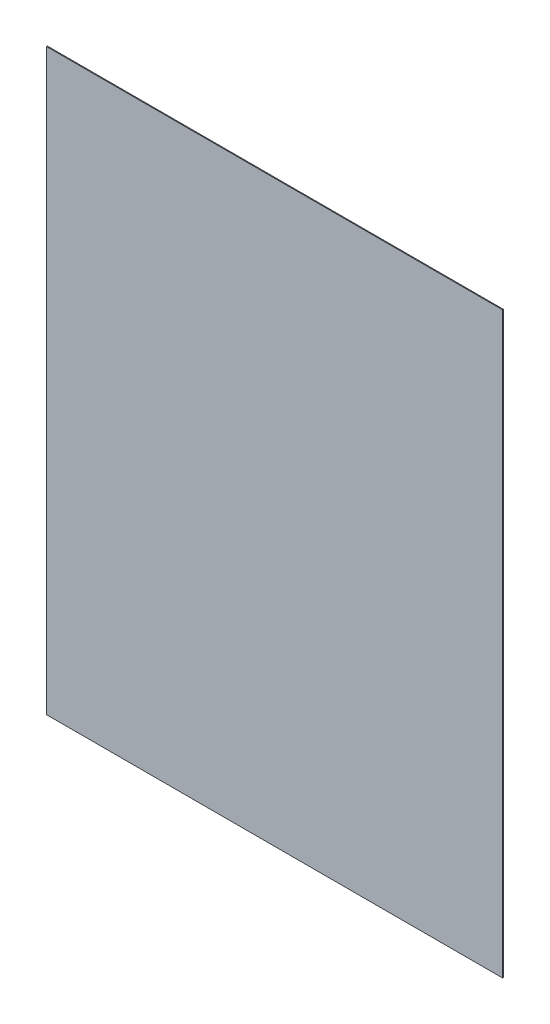
ISO-10303-21;
HEADER;
FILE_DESCRIPTION(('STEP AP214'),'2;1');
FILE_NAME('part.step','',(''),(''),'','','');
FILE_SCHEMA(('AUTOMOTIVE_DESIGN { 1 0 10303 214 1 1 1 1 }'));
ENDSEC;
DATA;
#1=APPLICATION_CONTEXT('core data for automotive mechanical design processes');
#2=APPLICATION_PROTOCOL_DEFINITION('international standard','automotive_design',2000,#1);
#3=PRODUCT_CONTEXT('',#1,'mechanical');
#4=PRODUCT('Part','Part','',(#3));
#5=PRODUCT_RELATED_PRODUCT_CATEGORY('part','',(#4));
#6=PRODUCT_DEFINITION_FORMATION('','',#4);
#7=PRODUCT_DEFINITION_CONTEXT('part definition',#1,'design');
#8=PRODUCT_DEFINITION('design','',#6,#7);
#9=PRODUCT_DEFINITION_SHAPE('','',#8);
#10=(LENGTH_UNIT() NAMED_UNIT(*) SI_UNIT(.MILLI.,.METRE.));
#11=(NAMED_UNIT(*) PLANE_ANGLE_UNIT() SI_UNIT($,.RADIAN.));
#12=(NAMED_UNIT(*) SI_UNIT($,.STERADIAN.) SOLID_ANGLE_UNIT());
#13=UNCERTAINTY_MEASURE_WITH_UNIT(LENGTH_MEASURE(1.E-05),#10,'distance_accuracy_value','');
#14=(GEOMETRIC_REPRESENTATION_CONTEXT(3) GLOBAL_UNCERTAINTY_ASSIGNED_CONTEXT((#13)) GLOBAL_UNIT_ASSIGNED_CONTEXT((#10,
#11,#12)) REPRESENTATION_CONTEXT('',''));
#15=CARTESIAN_POINT('',(0.,0.,0.));
#16=DIRECTION('',(0.,0.,1.));
#17=DIRECTION('',(1.,0.,0.));
#18=AXIS2_PLACEMENT_3D('',#15,#16,#17);
#19=CARTESIAN_POINT('',(260.5,-330.5,1.));
#20=DIRECTION('',(-1.,0.,0.));
#21=DIRECTION('',(0.,0.,1.));
#22=AXIS2_PLACEMENT_3D('',#19,#20,#21);
#23=PLANE('',#22);
#24=DIRECTION('',(0.,1.,0.));
#25=VECTOR('',#24,1.);
#26=CARTESIAN_POINT('',(260.5,-330.5,0.));
#27=LINE('',#26,#25);
#28=CARTESIAN_POINT('',(260.5,-330.5,0.));
#29=VERTEX_POINT('',#28);
#30=CARTESIAN_POINT('',(260.5,330.5,0.));
#31=VERTEX_POINT('',#30);
#32=EDGE_CURVE('E107',#29,#31,#27,.T.);
#33=ORIENTED_EDGE('',*,*,#32,.T.);
#34=DIRECTION('',(0.,0.,-1.));
#35=VECTOR('',#34,1.);
#36=CARTESIAN_POINT('',(260.5,330.5,1.));
#37=LINE('',#36,#35);
#38=CARTESIAN_POINT('',(260.5,330.5,1.));
#39=VERTEX_POINT('',#38);
#40=EDGE_CURVE('E11',#39,#31,#37,.T.);
#41=ORIENTED_EDGE('',*,*,#40,.F.);
#42=DIRECTION('',(0.,1.,0.));
#43=VECTOR('',#42,1.);
#44=CARTESIAN_POINT('',(260.5,-330.5,1.));
#45=LINE('',#44,#43);
#46=CARTESIAN_POINT('',(260.5,-330.5,1.));
#47=VERTEX_POINT('',#46);
#48=EDGE_CURVE('E91',#47,#39,#45,.T.);
#49=ORIENTED_EDGE('',*,*,#48,.F.);
#50=DIRECTION('',(0.,0.,-1.));
#51=VECTOR('',#50,1.);
#52=CARTESIAN_POINT('',(260.5,-330.5,1.));
#53=LINE('',#52,#51);
#54=EDGE_CURVE('E103',#47,#29,#53,.T.);
#55=ORIENTED_EDGE('',*,*,#54,.T.);
#56=EDGE_LOOP('',(#33,#41,#49,#55));
#57=FACE_BOUND('',#56,.T.);
#58=ADVANCED_FACE('F39',(#57),#23,.F.);
#59=CARTESIAN_POINT('',(-260.5,330.5,1.));
#60=DIRECTION('',(0.,-1.,0.));
#61=DIRECTION('',(0.,0.,-1.));
#62=AXIS2_PLACEMENT_3D('',#59,#60,#61);
#63=PLANE('',#62);
#64=DIRECTION('',(-1.,0.,0.));
#65=VECTOR('',#64,1.);
#66=CARTESIAN_POINT('',(-260.5,330.5,0.));
#67=LINE('',#66,#65);
#68=CARTESIAN_POINT('',(-260.5,330.5,0.));
#69=VERTEX_POINT('',#68);
#70=EDGE_CURVE('E96',#31,#69,#67,.T.);
#71=ORIENTED_EDGE('',*,*,#70,.T.);
#72=DIRECTION('',(0.,0.,-1.));
#73=VECTOR('',#72,1.);
#74=CARTESIAN_POINT('',(-260.5,330.5,1.));
#75=LINE('',#74,#73);
#76=CARTESIAN_POINT('',(-260.5,330.5,1.));
#77=VERTEX_POINT('',#76);
#78=EDGE_CURVE('E48',#77,#69,#75,.T.);
#79=ORIENTED_EDGE('',*,*,#78,.F.);
#80=DIRECTION('',(-1.,0.,0.));
#81=VECTOR('',#80,1.);
#82=CARTESIAN_POINT('',(-260.5,330.5,1.));
#83=LINE('',#82,#81);
#84=EDGE_CURVE('E86',#39,#77,#83,.T.);
#85=ORIENTED_EDGE('',*,*,#84,.F.);
#86=ORIENTED_EDGE('',*,*,#40,.T.);
#87=EDGE_LOOP('',(#71,#79,#85,#86));
#88=FACE_BOUND('',#87,.T.);
#89=ADVANCED_FACE('F95',(#88),#63,.F.);
#90=CARTESIAN_POINT('',(-260.5,-330.5,1.));
#91=DIRECTION('',(1.,0.,0.));
#92=DIRECTION('',(0.,0.,-1.));
#93=AXIS2_PLACEMENT_3D('',#90,#91,#92);
#94=PLANE('',#93);
#95=DIRECTION('',(0.,-1.,0.));
#96=VECTOR('',#95,1.);
#97=CARTESIAN_POINT('',(-260.5,-330.5,0.));
#98=LINE('',#97,#96);
#99=CARTESIAN_POINT('',(-260.5,-330.5,0.));
#100=VERTEX_POINT('',#99);
#101=EDGE_CURVE('E73',#69,#100,#98,.T.);
#102=ORIENTED_EDGE('',*,*,#101,.T.);
#103=DIRECTION('',(0.,0.,-1.));
#104=VECTOR('',#103,1.);
#105=CARTESIAN_POINT('',(-260.5,-330.5,1.));
#106=LINE('',#105,#104);
#107=CARTESIAN_POINT('',(-260.5,-330.5,1.));
#108=VERTEX_POINT('',#107);
#109=EDGE_CURVE('E98',#108,#100,#106,.T.);
#110=ORIENTED_EDGE('',*,*,#109,.F.);
#111=DIRECTION('',(0.,-1.,0.));
#112=VECTOR('',#111,1.);
#113=CARTESIAN_POINT('',(-260.5,-330.5,1.));
#114=LINE('',#113,#112);
#115=EDGE_CURVE('E89',#77,#108,#114,.T.);
#116=ORIENTED_EDGE('',*,*,#115,.F.);
#117=ORIENTED_EDGE('',*,*,#78,.T.);
#118=EDGE_LOOP('',(#102,#110,#116,#117));
#119=FACE_BOUND('',#118,.T.);
#120=ADVANCED_FACE('F99',(#119),#94,.F.);
#121=CARTESIAN_POINT('',(-260.5,-330.5,1.));
#122=DIRECTION('',(0.,1.,0.));
#123=DIRECTION('',(0.,0.,1.));
#124=AXIS2_PLACEMENT_3D('',#121,#122,#123);
#125=PLANE('',#124);
#126=DIRECTION('',(1.,0.,0.));
#127=VECTOR('',#126,1.);
#128=CARTESIAN_POINT('',(-260.5,-330.5,0.));
#129=LINE('',#128,#127);
#130=EDGE_CURVE('E79',#100,#29,#129,.T.);
#131=ORIENTED_EDGE('',*,*,#130,.T.);
#132=ORIENTED_EDGE('',*,*,#54,.F.);
#133=DIRECTION('',(1.,0.,0.));
#134=VECTOR('',#133,1.);
#135=CARTESIAN_POINT('',(-260.5,-330.5,1.));
#136=LINE('',#135,#134);
#137=EDGE_CURVE('E56',#108,#47,#136,.T.);
#138=ORIENTED_EDGE('',*,*,#137,.F.);
#139=ORIENTED_EDGE('',*,*,#109,.T.);
#140=EDGE_LOOP('',(#131,#132,#138,#139));
#141=FACE_BOUND('',#140,.T.);
#142=ADVANCED_FACE('F120',(#141),#125,.F.);
#143=CARTESIAN_POINT('',(0.,0.,1.));
#144=DIRECTION('',(0.,0.,-1.));
#145=DIRECTION('',(-1.,0.,0.));
#146=AXIS2_PLACEMENT_3D('',#143,#144,#145);
#147=PLANE('',#146);
#148=ORIENTED_EDGE('',*,*,#48,.T.);
#149=ORIENTED_EDGE('',*,*,#84,.T.);
#150=ORIENTED_EDGE('',*,*,#115,.T.);
#151=ORIENTED_EDGE('',*,*,#137,.T.);
#152=EDGE_LOOP('',(#148,#149,#150,#151));
#153=FACE_BOUND('',#152,.T.);
#154=ADVANCED_FACE('F87',(#153),#147,.F.);
#155=CARTESIAN_POINT('',(0.,0.,0.));
#156=DIRECTION('',(0.,0.,-1.));
#157=DIRECTION('',(-1.,0.,0.));
#158=AXIS2_PLACEMENT_3D('',#155,#156,#157);
#159=PLANE('',#158);
#160=ORIENTED_EDGE('',*,*,#32,.F.);
#161=ORIENTED_EDGE('',*,*,#130,.F.);
#162=ORIENTED_EDGE('',*,*,#101,.F.);
#163=ORIENTED_EDGE('',*,*,#70,.F.);
#164=EDGE_LOOP('',(#160,#161,#162,#163));
#165=FACE_BOUND('',#164,.T.);
#166=ADVANCED_FACE('F123',(#165),#159,.T.);
#167=CLOSED_SHELL('',(#58,#89,#120,#142,#154,#166));
#168=MANIFOLD_SOLID_BREP('B2',#167);
#169=ADVANCED_BREP_SHAPE_REPRESENTATION('',(#18,#168),#14);
#170=SHAPE_DEFINITION_REPRESENTATION(#9,#169);
ENDSEC;
END-ISO-10303-21;
